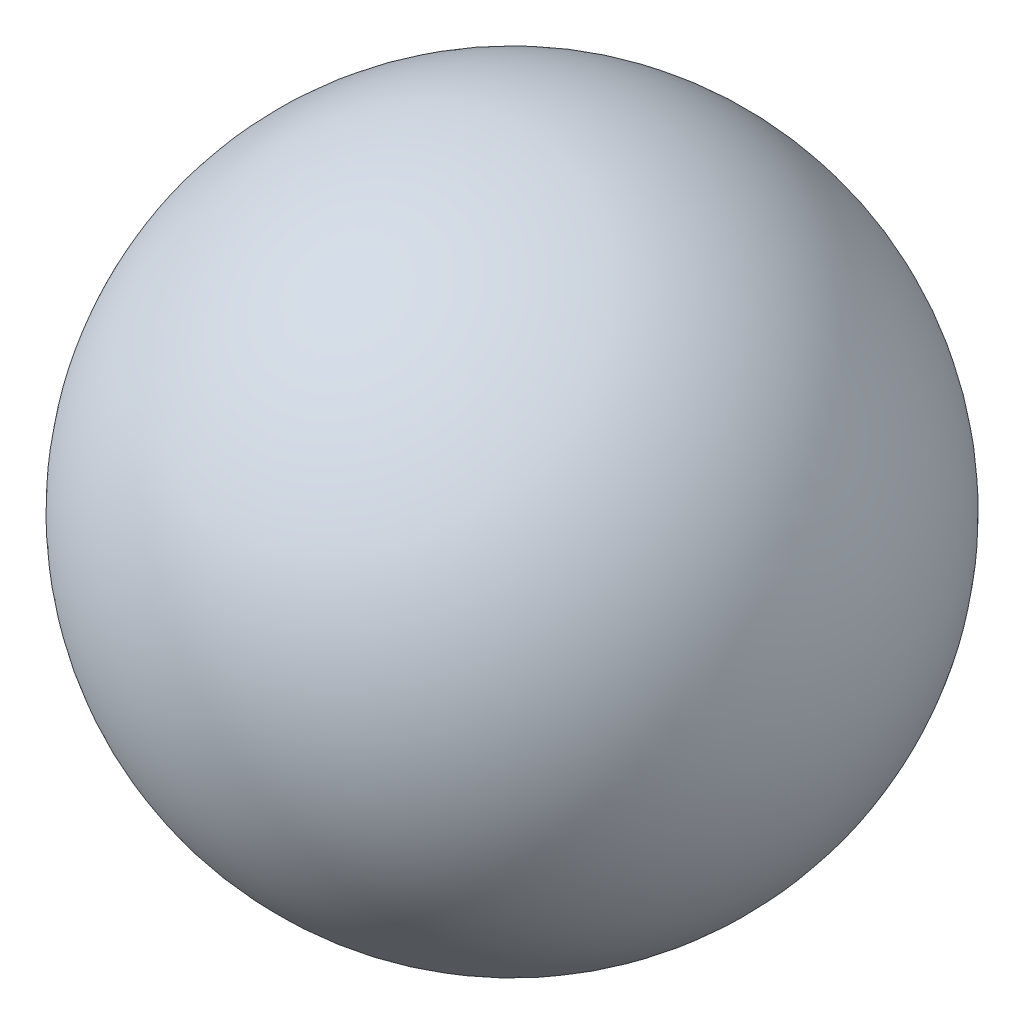
ISO-10303-21;
HEADER;
FILE_DESCRIPTION(('STEP AP214'),'2;1');
FILE_NAME('part.step','',(''),(''),'','','');
FILE_SCHEMA(('AUTOMOTIVE_DESIGN { 1 0 10303 214 1 1 1 1 }'));
ENDSEC;
DATA;
#1=APPLICATION_CONTEXT('core data for automotive mechanical design processes');
#2=APPLICATION_PROTOCOL_DEFINITION('international standard','automotive_design',2000,#1);
#3=PRODUCT_CONTEXT('',#1,'mechanical');
#4=PRODUCT('Part','Part','',(#3));
#5=PRODUCT_RELATED_PRODUCT_CATEGORY('part','',(#4));
#6=PRODUCT_DEFINITION_FORMATION('','',#4);
#7=PRODUCT_DEFINITION_CONTEXT('part definition',#1,'design');
#8=PRODUCT_DEFINITION('design','',#6,#7);
#9=PRODUCT_DEFINITION_SHAPE('','',#8);
#10=(LENGTH_UNIT() NAMED_UNIT(*) SI_UNIT(.MILLI.,.METRE.));
#11=(NAMED_UNIT(*) PLANE_ANGLE_UNIT() SI_UNIT($,.RADIAN.));
#12=(NAMED_UNIT(*) SI_UNIT($,.STERADIAN.) SOLID_ANGLE_UNIT());
#13=UNCERTAINTY_MEASURE_WITH_UNIT(LENGTH_MEASURE(1.E-05),#10,'distance_accuracy_value','');
#14=(GEOMETRIC_REPRESENTATION_CONTEXT(3) GLOBAL_UNCERTAINTY_ASSIGNED_CONTEXT((#13)) GLOBAL_UNIT_ASSIGNED_CONTEXT((#10,
#11,#12)) REPRESENTATION_CONTEXT('',''));
#15=CARTESIAN_POINT('',(0.,0.,0.));
#16=DIRECTION('',(0.,0.,1.));
#17=DIRECTION('',(1.,0.,0.));
#18=AXIS2_PLACEMENT_3D('',#15,#16,#17);
#19=CARTESIAN_POINT('',(4.99304671054956,-2.5,1.62233922046847));
#20=DIRECTION('',(1.,0.,0.));
#21=DIRECTION('',(0.,-1.,0.));
#22=AXIS2_PLACEMENT_3D('',#19,#20,#21);
#23=SPHERICAL_SURFACE('',#22,1.35);
#24=CARTESIAN_POINT('',(6.34304671054956,-2.5,1.62233922046847));
#25=VERTEX_POINT('',#24);
#26=VERTEX_LOOP('',#25);
#27=FACE_BOUND('',#26,.T.);
#28=ADVANCED_FACE('F28',(#27),#23,.T.);
#29=CLOSED_SHELL('',(#28));
#30=MANIFOLD_SOLID_BREP('B2',#29);
#31=ADVANCED_BREP_SHAPE_REPRESENTATION('',(#18,#30),#14);
#32=SHAPE_DEFINITION_REPRESENTATION(#9,#31);
ENDSEC;
END-ISO-10303-21;
